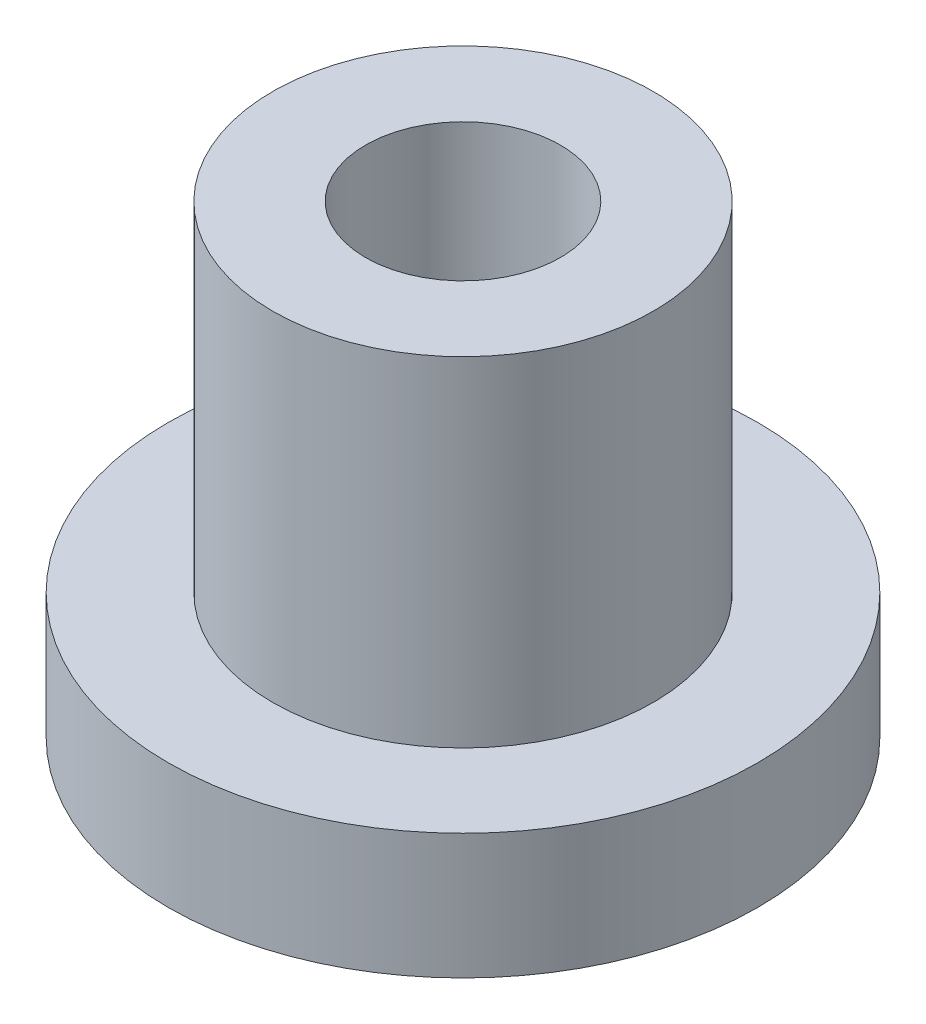
ISO-10303-21;
HEADER;
FILE_DESCRIPTION(('STEP AP214'),'2;1');
FILE_NAME('part.step','',(''),(''),'','','');
FILE_SCHEMA(('AUTOMOTIVE_DESIGN { 1 0 10303 214 1 1 1 1 }'));
ENDSEC;
DATA;
#1=APPLICATION_CONTEXT('core data for automotive mechanical design processes');
#2=APPLICATION_PROTOCOL_DEFINITION('international standard','automotive_design',2000,#1);
#3=PRODUCT_CONTEXT('',#1,'mechanical');
#4=PRODUCT('Part','Part','',(#3));
#5=PRODUCT_RELATED_PRODUCT_CATEGORY('part','',(#4));
#6=PRODUCT_DEFINITION_FORMATION('','',#4);
#7=PRODUCT_DEFINITION_CONTEXT('part definition',#1,'design');
#8=PRODUCT_DEFINITION('design','',#6,#7);
#9=PRODUCT_DEFINITION_SHAPE('','',#8);
#10=(LENGTH_UNIT() NAMED_UNIT(*) SI_UNIT(.MILLI.,.METRE.));
#11=(NAMED_UNIT(*) PLANE_ANGLE_UNIT() SI_UNIT($,.RADIAN.));
#12=(NAMED_UNIT(*) SI_UNIT($,.STERADIAN.) SOLID_ANGLE_UNIT());
#13=UNCERTAINTY_MEASURE_WITH_UNIT(LENGTH_MEASURE(1.E-05),#10,'distance_accuracy_value','');
#14=(GEOMETRIC_REPRESENTATION_CONTEXT(3) GLOBAL_UNCERTAINTY_ASSIGNED_CONTEXT((#13)) GLOBAL_UNIT_ASSIGNED_CONTEXT((#10,
#11,#12)) REPRESENTATION_CONTEXT('',''));
#15=CARTESIAN_POINT('',(0.,0.,0.));
#16=DIRECTION('',(0.,0.,1.));
#17=DIRECTION('',(1.,0.,0.));
#18=AXIS2_PLACEMENT_3D('',#15,#16,#17);
#19=CARTESIAN_POINT('',(0.,10.,0.));
#20=DIRECTION('',(0.,-1.,0.));
#21=DIRECTION('',(0.,0.,-1.));
#22=AXIS2_PLACEMENT_3D('',#19,#20,#21);
#23=CYLINDRICAL_SURFACE('',#22,6.35);
#24=CARTESIAN_POINT('',(0.,0.,0.));
#25=DIRECTION('',(0.,1.,0.));
#26=DIRECTION('',(0.,0.,1.));
#27=AXIS2_PLACEMENT_3D('',#24,#25,#26);
#28=CIRCLE('',#27,6.35);
#29=CARTESIAN_POINT('',(0.,0.,6.35));
#30=VERTEX_POINT('',#29);
#31=EDGE_CURVE('E11',#30,#30,#28,.T.);
#32=ORIENTED_EDGE('',*,*,#31,.T.);
#33=EDGE_LOOP('',(#32));
#34=FACE_BOUND('',#33,.T.);
#35=CARTESIAN_POINT('',(0.,2.7,0.));
#36=DIRECTION('',(0.,1.,0.));
#37=DIRECTION('',(0.,0.,1.));
#38=AXIS2_PLACEMENT_3D('',#35,#36,#37);
#39=CIRCLE('',#38,6.35);
#40=CARTESIAN_POINT('',(0.,2.7,6.35));
#41=VERTEX_POINT('',#40);
#42=EDGE_CURVE('E47',#41,#41,#39,.T.);
#43=ORIENTED_EDGE('',*,*,#42,.F.);
#44=EDGE_LOOP('',(#43));
#45=FACE_BOUND('',#44,.T.);
#46=ADVANCED_FACE('F44',(#34,#45),#23,.T.);
#47=CARTESIAN_POINT('',(0.,10.,0.));
#48=DIRECTION('',(0.,1.,0.));
#49=DIRECTION('',(0.,0.,1.));
#50=AXIS2_PLACEMENT_3D('',#47,#48,#49);
#51=PLANE('',#50);
#52=CARTESIAN_POINT('',(0.,10.,0.));
#53=DIRECTION('',(0.,1.,0.));
#54=DIRECTION('',(0.,0.,1.));
#55=AXIS2_PLACEMENT_3D('',#52,#53,#54);
#56=CIRCLE('',#55,2.1);
#57=CARTESIAN_POINT('',(0.,10.,2.1));
#58=VERTEX_POINT('',#57);
#59=EDGE_CURVE('E57',#58,#58,#56,.T.);
#60=ORIENTED_EDGE('',*,*,#59,.F.);
#61=EDGE_LOOP('',(#60));
#62=FACE_BOUND('',#61,.T.);
#63=CARTESIAN_POINT('',(0.,10.,0.));
#64=DIRECTION('',(0.,1.,0.));
#65=DIRECTION('',(0.,0.,1.));
#66=AXIS2_PLACEMENT_3D('',#63,#64,#65);
#67=CIRCLE('',#66,4.1);
#68=CARTESIAN_POINT('',(0.,10.,4.1));
#69=VERTEX_POINT('',#68);
#70=EDGE_CURVE('E63',#69,#69,#67,.T.);
#71=ORIENTED_EDGE('',*,*,#70,.T.);
#72=EDGE_LOOP('',(#71));
#73=FACE_BOUND('',#72,.T.);
#74=ADVANCED_FACE('F79',(#62,#73),#51,.T.);
#75=CARTESIAN_POINT('',(0.,0.,0.));
#76=DIRECTION('',(0.,1.,0.));
#77=DIRECTION('',(0.,0.,1.));
#78=AXIS2_PLACEMENT_3D('',#75,#76,#77);
#79=PLANE('',#78);
#80=CARTESIAN_POINT('',(0.,0.,0.));
#81=DIRECTION('',(0.,1.,0.));
#82=DIRECTION('',(0.,0.,1.));
#83=AXIS2_PLACEMENT_3D('',#80,#81,#82);
#84=CIRCLE('',#83,2.1);
#85=CARTESIAN_POINT('',(0.,0.,2.1));
#86=VERTEX_POINT('',#85);
#87=EDGE_CURVE('E52',#86,#86,#84,.T.);
#88=ORIENTED_EDGE('',*,*,#87,.T.);
#89=EDGE_LOOP('',(#88));
#90=FACE_BOUND('',#89,.T.);
#91=ORIENTED_EDGE('',*,*,#31,.F.);
#92=EDGE_LOOP('',(#91));
#93=FACE_BOUND('',#92,.T.);
#94=ADVANCED_FACE('F83',(#90,#93),#79,.F.);
#95=CARTESIAN_POINT('',(0.,0.,0.));
#96=DIRECTION('',(0.,1.,0.));
#97=DIRECTION('',(0.,0.,1.));
#98=AXIS2_PLACEMENT_3D('',#95,#96,#97);
#99=CYLINDRICAL_SURFACE('',#98,2.1);
#100=ORIENTED_EDGE('',*,*,#87,.F.);
#101=EDGE_LOOP('',(#100));
#102=FACE_BOUND('',#101,.T.);
#103=ORIENTED_EDGE('',*,*,#59,.T.);
#104=EDGE_LOOP('',(#103));
#105=FACE_BOUND('',#104,.T.);
#106=ADVANCED_FACE('F89',(#102,#105),#99,.F.);
#107=CARTESIAN_POINT('',(0.,2.7,0.));
#108=DIRECTION('',(0.,1.,0.));
#109=DIRECTION('',(0.,0.,1.));
#110=AXIS2_PLACEMENT_3D('',#107,#108,#109);
#111=PLANE('',#110);
#112=CARTESIAN_POINT('',(0.,2.7,0.));
#113=DIRECTION('',(0.,1.,0.));
#114=DIRECTION('',(0.,0.,1.));
#115=AXIS2_PLACEMENT_3D('',#112,#113,#114);
#116=CIRCLE('',#115,4.1);
#117=CARTESIAN_POINT('',(0.,2.7,4.1));
#118=VERTEX_POINT('',#117);
#119=EDGE_CURVE('E67',#118,#118,#116,.T.);
#120=ORIENTED_EDGE('',*,*,#119,.F.);
#121=EDGE_LOOP('',(#120));
#122=FACE_BOUND('',#121,.T.);
#123=ORIENTED_EDGE('',*,*,#42,.T.);
#124=EDGE_LOOP('',(#123));
#125=FACE_BOUND('',#124,.T.);
#126=ADVANCED_FACE('F76',(#122,#125),#111,.T.);
#127=CARTESIAN_POINT('',(0.,2.7,0.));
#128=DIRECTION('',(0.,1.,0.));
#129=DIRECTION('',(0.,0.,1.));
#130=AXIS2_PLACEMENT_3D('',#127,#128,#129);
#131=CYLINDRICAL_SURFACE('',#130,4.1);
#132=ORIENTED_EDGE('',*,*,#119,.T.);
#133=EDGE_LOOP('',(#132));
#134=FACE_BOUND('',#133,.T.);
#135=ORIENTED_EDGE('',*,*,#70,.F.);
#136=EDGE_LOOP('',(#135));
#137=FACE_BOUND('',#136,.T.);
#138=ADVANCED_FACE('F99',(#134,#137),#131,.T.);
#139=CLOSED_SHELL('',(#46,#74,#94,#106,#126,#138));
#140=MANIFOLD_SOLID_BREP('B2',#139);
#141=ADVANCED_BREP_SHAPE_REPRESENTATION('',(#18,#140),#14);
#142=SHAPE_DEFINITION_REPRESENTATION(#9,#141);
ENDSEC;
END-ISO-10303-21;
